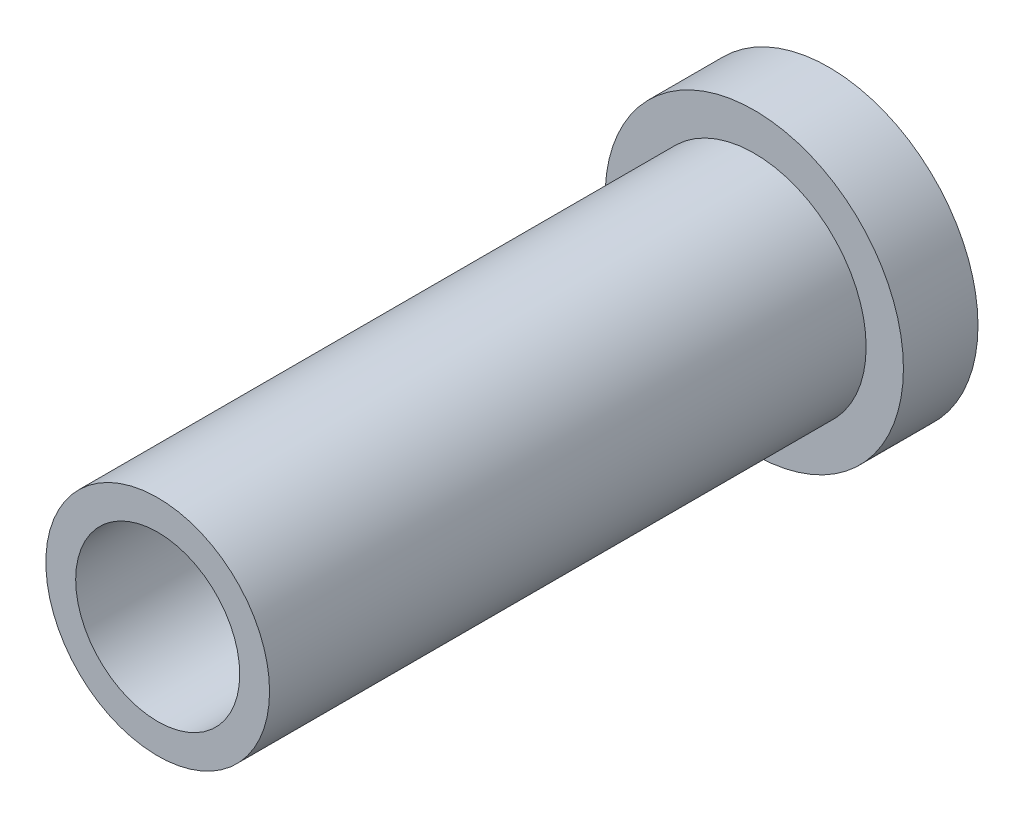
ISO-10303-21;
HEADER;
FILE_DESCRIPTION(('STEP AP214'),'2;1');
FILE_NAME('part.step','',(''),(''),'','','');
FILE_SCHEMA(('AUTOMOTIVE_DESIGN { 1 0 10303 214 1 1 1 1 }'));
ENDSEC;
DATA;
#1=APPLICATION_CONTEXT('core data for automotive mechanical design processes');
#2=APPLICATION_PROTOCOL_DEFINITION('international standard','automotive_design',2000,#1);
#3=PRODUCT_CONTEXT('',#1,'mechanical');
#4=PRODUCT('Part','Part','',(#3));
#5=PRODUCT_RELATED_PRODUCT_CATEGORY('part','',(#4));
#6=PRODUCT_DEFINITION_FORMATION('','',#4);
#7=PRODUCT_DEFINITION_CONTEXT('part definition',#1,'design');
#8=PRODUCT_DEFINITION('design','',#6,#7);
#9=PRODUCT_DEFINITION_SHAPE('','',#8);
#10=(LENGTH_UNIT() NAMED_UNIT(*) SI_UNIT(.MILLI.,.METRE.));
#11=(NAMED_UNIT(*) PLANE_ANGLE_UNIT() SI_UNIT($,.RADIAN.));
#12=(NAMED_UNIT(*) SI_UNIT($,.STERADIAN.) SOLID_ANGLE_UNIT());
#13=UNCERTAINTY_MEASURE_WITH_UNIT(LENGTH_MEASURE(1.E-05),#10,'distance_accuracy_value','');
#14=(GEOMETRIC_REPRESENTATION_CONTEXT(3) GLOBAL_UNCERTAINTY_ASSIGNED_CONTEXT((#13)) GLOBAL_UNIT_ASSIGNED_CONTEXT((#10,
#11,#12)) REPRESENTATION_CONTEXT('',''));
#15=CARTESIAN_POINT('',(0.,0.,0.));
#16=DIRECTION('',(0.,0.,1.));
#17=DIRECTION('',(1.,0.,0.));
#18=AXIS2_PLACEMENT_3D('',#15,#16,#17);
#19=CARTESIAN_POINT('',(0.,0.,5.));
#20=DIRECTION('',(0.,0.,-1.));
#21=DIRECTION('',(-1.,0.,0.));
#22=AXIS2_PLACEMENT_3D('',#19,#20,#21);
#23=CYLINDRICAL_SURFACE('',#22,10.);
#24=CARTESIAN_POINT('',(0.,0.,5.));
#25=DIRECTION('',(0.,0.,1.));
#26=DIRECTION('',(1.,0.,0.));
#27=AXIS2_PLACEMENT_3D('',#24,#25,#26);
#28=CIRCLE('',#27,10.);
#29=CARTESIAN_POINT('',(10.,0.,5.));
#30=VERTEX_POINT('',#29);
#31=EDGE_CURVE('E49',#30,#30,#28,.T.);
#32=ORIENTED_EDGE('',*,*,#31,.F.);
#33=EDGE_LOOP('',(#32));
#34=FACE_BOUND('',#33,.T.);
#35=CARTESIAN_POINT('',(0.,0.,0.));
#36=DIRECTION('',(0.,0.,1.));
#37=DIRECTION('',(1.,0.,0.));
#38=AXIS2_PLACEMENT_3D('',#35,#36,#37);
#39=CIRCLE('',#38,10.);
#40=CARTESIAN_POINT('',(10.,0.,0.));
#41=VERTEX_POINT('',#40);
#42=EDGE_CURVE('E44',#41,#41,#39,.T.);
#43=ORIENTED_EDGE('',*,*,#42,.T.);
#44=EDGE_LOOP('',(#43));
#45=FACE_BOUND('',#44,.T.);
#46=ADVANCED_FACE('F41',(#34,#45),#23,.T.);
#47=CARTESIAN_POINT('',(0.,0.,5.));
#48=DIRECTION('',(0.,0.,1.));
#49=DIRECTION('',(1.,0.,0.));
#50=AXIS2_PLACEMENT_3D('',#47,#48,#49);
#51=PLANE('',#50);
#52=CARTESIAN_POINT('',(0.,0.,5.));
#53=DIRECTION('',(0.,0.,1.));
#54=DIRECTION('',(1.,0.,0.));
#55=AXIS2_PLACEMENT_3D('',#52,#53,#54);
#56=CIRCLE('',#55,7.5);
#57=CARTESIAN_POINT('',(7.5,0.,5.));
#58=VERTEX_POINT('',#57);
#59=EDGE_CURVE('E10',#58,#58,#56,.T.);
#60=ORIENTED_EDGE('',*,*,#59,.F.);
#61=EDGE_LOOP('',(#60));
#62=FACE_BOUND('',#61,.T.);
#63=ORIENTED_EDGE('',*,*,#31,.T.);
#64=EDGE_LOOP('',(#63));
#65=FACE_BOUND('',#64,.T.);
#66=ADVANCED_FACE('F77',(#62,#65),#51,.T.);
#67=CARTESIAN_POINT('',(0.,0.,0.));
#68=DIRECTION('',(0.,0.,1.));
#69=DIRECTION('',(1.,0.,0.));
#70=AXIS2_PLACEMENT_3D('',#67,#68,#69);
#71=PLANE('',#70);
#72=CARTESIAN_POINT('',(0.,0.,0.));
#73=DIRECTION('',(0.,0.,-1.));
#74=DIRECTION('',(-1.,0.,0.));
#75=AXIS2_PLACEMENT_3D('',#72,#73,#74);
#76=CIRCLE('',#75,5.5);
#77=CARTESIAN_POINT('',(-5.5,0.,0.));
#78=VERTEX_POINT('',#77);
#79=EDGE_CURVE('E64',#78,#78,#76,.T.);
#80=ORIENTED_EDGE('',*,*,#79,.F.);
#81=EDGE_LOOP('',(#80));
#82=FACE_BOUND('',#81,.T.);
#83=ORIENTED_EDGE('',*,*,#42,.F.);
#84=EDGE_LOOP('',(#83));
#85=FACE_BOUND('',#84,.T.);
#86=ADVANCED_FACE('F73',(#82,#85),#71,.F.);
#87=CARTESIAN_POINT('',(0.,0.,45.));
#88=DIRECTION('',(0.,0.,-1.));
#89=DIRECTION('',(-1.,0.,0.));
#90=AXIS2_PLACEMENT_3D('',#87,#88,#89);
#91=CYLINDRICAL_SURFACE('',#90,7.5);
#92=CARTESIAN_POINT('',(0.,0.,45.));
#93=DIRECTION('',(0.,0.,1.));
#94=DIRECTION('',(1.,0.,0.));
#95=AXIS2_PLACEMENT_3D('',#92,#93,#94);
#96=CIRCLE('',#95,7.5);
#97=CARTESIAN_POINT('',(7.5,0.,45.));
#98=VERTEX_POINT('',#97);
#99=EDGE_CURVE('E57',#98,#98,#96,.T.);
#100=ORIENTED_EDGE('',*,*,#99,.F.);
#101=EDGE_LOOP('',(#100));
#102=FACE_BOUND('',#101,.T.);
#103=ORIENTED_EDGE('',*,*,#59,.T.);
#104=EDGE_LOOP('',(#103));
#105=FACE_BOUND('',#104,.T.);
#106=ADVANCED_FACE('F76',(#102,#105),#91,.T.);
#107=CARTESIAN_POINT('',(0.,0.,45.));
#108=DIRECTION('',(0.,0.,1.));
#109=DIRECTION('',(1.,0.,0.));
#110=AXIS2_PLACEMENT_3D('',#107,#108,#109);
#111=PLANE('',#110);
#112=CARTESIAN_POINT('',(0.,0.,45.));
#113=DIRECTION('',(0.,0.,1.));
#114=DIRECTION('',(1.,0.,0.));
#115=AXIS2_PLACEMENT_3D('',#112,#113,#114);
#116=CIRCLE('',#115,5.5);
#117=CARTESIAN_POINT('',(5.5,0.,45.));
#118=VERTEX_POINT('',#117);
#119=EDGE_CURVE('E61',#118,#118,#116,.F.);
#120=ORIENTED_EDGE('',*,*,#119,.T.);
#121=EDGE_LOOP('',(#120));
#122=FACE_BOUND('',#121,.T.);
#123=ORIENTED_EDGE('',*,*,#99,.T.);
#124=EDGE_LOOP('',(#123));
#125=FACE_BOUND('',#124,.T.);
#126=ADVANCED_FACE('F93',(#122,#125),#111,.T.);
#127=CARTESIAN_POINT('',(0.,0.,60.556349186104));
#128=DIRECTION('',(0.,0.,-1.));
#129=DIRECTION('',(-1.,0.,0.));
#130=AXIS2_PLACEMENT_3D('',#127,#128,#129);
#131=CYLINDRICAL_SURFACE('',#130,5.5);
#132=ORIENTED_EDGE('',*,*,#79,.T.);
#133=EDGE_LOOP('',(#132));
#134=FACE_BOUND('',#133,.T.);
#135=ORIENTED_EDGE('',*,*,#119,.F.);
#136=EDGE_LOOP('',(#135));
#137=FACE_BOUND('',#136,.T.);
#138=ADVANCED_FACE('F70',(#134,#137),#131,.F.);
#139=CLOSED_SHELL('',(#46,#66,#86,#106,#126,#138));
#140=MANIFOLD_SOLID_BREP('B2',#139);
#141=ADVANCED_BREP_SHAPE_REPRESENTATION('',(#18,#140),#14);
#142=SHAPE_DEFINITION_REPRESENTATION(#9,#141);
ENDSEC;
END-ISO-10303-21;
